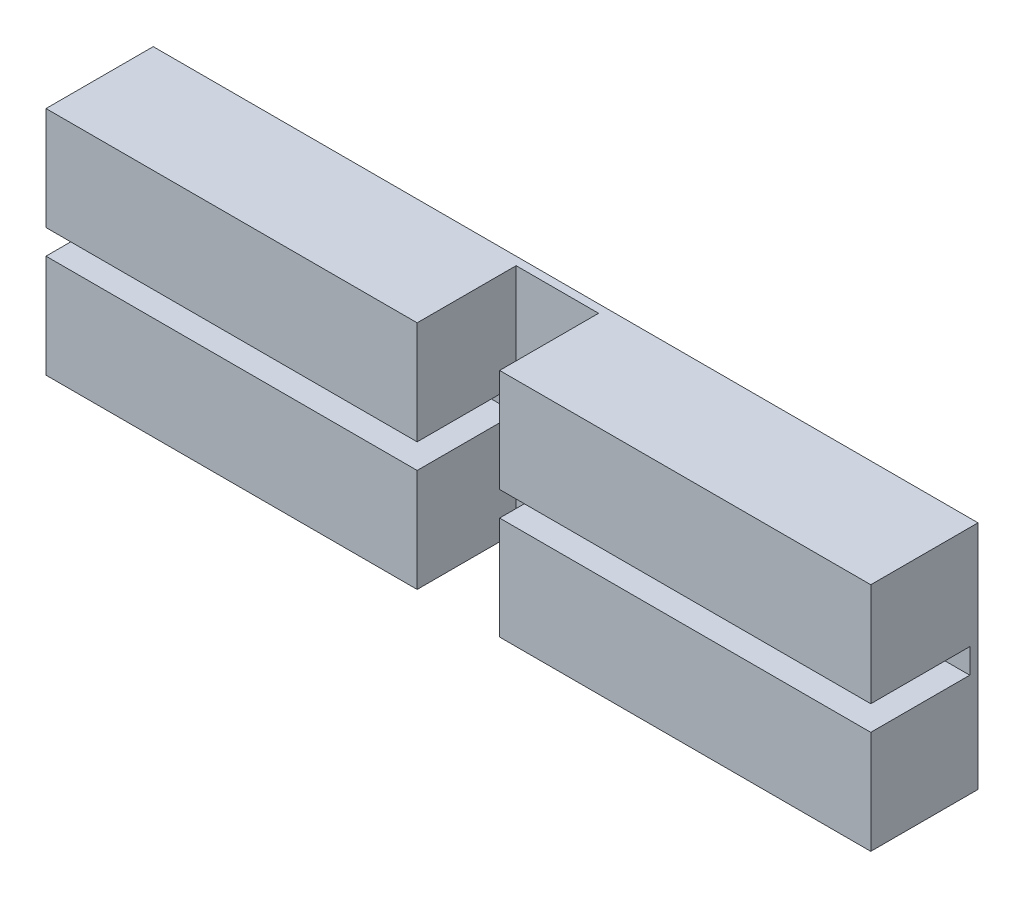
ISO-10303-21;
HEADER;
FILE_DESCRIPTION(('STEP AP214'),'2;1');
FILE_NAME('part.step','',(''),(''),'','','');
FILE_SCHEMA(('AUTOMOTIVE_DESIGN { 1 0 10303 214 1 1 1 1 }'));
ENDSEC;
DATA;
#1=APPLICATION_CONTEXT('core data for automotive mechanical design processes');
#2=APPLICATION_PROTOCOL_DEFINITION('international standard','automotive_design',2000,#1);
#3=PRODUCT_CONTEXT('',#1,'mechanical');
#4=PRODUCT('Part','Part','',(#3));
#5=PRODUCT_RELATED_PRODUCT_CATEGORY('part','',(#4));
#6=PRODUCT_DEFINITION_FORMATION('','',#4);
#7=PRODUCT_DEFINITION_CONTEXT('part definition',#1,'design');
#8=PRODUCT_DEFINITION('design','',#6,#7);
#9=PRODUCT_DEFINITION_SHAPE('','',#8);
#10=(LENGTH_UNIT() NAMED_UNIT(*) SI_UNIT(.MILLI.,.METRE.));
#11=(NAMED_UNIT(*) PLANE_ANGLE_UNIT() SI_UNIT($,.RADIAN.));
#12=(NAMED_UNIT(*) SI_UNIT($,.STERADIAN.) SOLID_ANGLE_UNIT());
#13=UNCERTAINTY_MEASURE_WITH_UNIT(LENGTH_MEASURE(1.E-05),#10,'distance_accuracy_value','');
#14=(GEOMETRIC_REPRESENTATION_CONTEXT(3) GLOBAL_UNCERTAINTY_ASSIGNED_CONTEXT((#13)) GLOBAL_UNIT_ASSIGNED_CONTEXT((#10,
#11,#12)) REPRESENTATION_CONTEXT('',''));
#15=CARTESIAN_POINT('',(0.,0.,0.));
#16=DIRECTION('',(0.,0.,1.));
#17=DIRECTION('',(1.,0.,0.));
#18=AXIS2_PLACEMENT_3D('',#15,#16,#17);
#19=CARTESIAN_POINT('',(0.,0.,2.6));
#20=DIRECTION('',(0.,0.,-1.));
#21=DIRECTION('',(-1.,0.,0.));
#22=AXIS2_PLACEMENT_3D('',#19,#20,#21);
#23=PLANE('',#22);
#24=DIRECTION('',(1.,0.,0.));
#25=VECTOR('',#24,1.);
#26=CARTESIAN_POINT('',(-10.,-0.300000000000002,2.6));
#27=LINE('',#26,#25);
#28=CARTESIAN_POINT('',(0.999999999999994,-0.300000000000002,2.6));
#29=VERTEX_POINT('',#28);
#30=CARTESIAN_POINT('',(9.99999999999999,-0.300000000000002,2.6));
#31=VERTEX_POINT('',#30);
#32=EDGE_CURVE('E223',#29,#31,#27,.T.);
#33=ORIENTED_EDGE('',*,*,#32,.F.);
#34=DIRECTION('',(0.,-1.,0.));
#35=VECTOR('',#34,1.);
#36=CARTESIAN_POINT('',(0.999999999999994,2.8,2.6));
#37=LINE('',#36,#35);
#38=CARTESIAN_POINT('',(0.999999999999994,-2.8,2.6));
#39=VERTEX_POINT('',#38);
#40=EDGE_CURVE('E159',#29,#39,#37,.T.);
#41=ORIENTED_EDGE('',*,*,#40,.T.);
#42=DIRECTION('',(1.,0.,0.));
#43=VECTOR('',#42,1.);
#44=CARTESIAN_POINT('',(-10.,-2.8,2.6));
#45=LINE('',#44,#43);
#46=CARTESIAN_POINT('',(9.99999999999999,-2.8,2.6));
#47=VERTEX_POINT('',#46);
#48=EDGE_CURVE('E186',#39,#47,#45,.T.);
#49=ORIENTED_EDGE('',*,*,#48,.T.);
#50=DIRECTION('',(0.,1.,0.));
#51=VECTOR('',#50,1.);
#52=CARTESIAN_POINT('',(9.99999999999999,-2.8,2.6));
#53=LINE('',#52,#51);
#54=EDGE_CURVE('E181',#47,#31,#53,.T.);
#55=ORIENTED_EDGE('',*,*,#54,.T.);
#56=EDGE_LOOP('',(#33,#41,#49,#55));
#57=FACE_BOUND('',#56,.T.);
#58=ADVANCED_FACE('F37',(#57),#23,.F.);
#59=DIRECTION('',(-1.,0.,0.));
#60=VECTOR('',#59,1.);
#61=CARTESIAN_POINT('',(-10.,2.8,2.6));
#62=LINE('',#61,#60);
#63=CARTESIAN_POINT('',(9.99999999999999,2.8,2.6));
#64=VERTEX_POINT('',#63);
#65=CARTESIAN_POINT('',(0.999999999999994,2.8,2.6));
#66=VERTEX_POINT('',#65);
#67=EDGE_CURVE('E165',#64,#66,#62,.T.);
#68=ORIENTED_EDGE('',*,*,#67,.T.);
#69=CARTESIAN_POINT('',(0.999999999999994,0.299999999999999,2.6));
#70=VERTEX_POINT('',#69);
#71=EDGE_CURVE('E150',#66,#70,#37,.T.);
#72=ORIENTED_EDGE('',*,*,#71,.T.);
#73=DIRECTION('',(1.,0.,0.));
#74=VECTOR('',#73,1.);
#75=CARTESIAN_POINT('',(-10.,0.299999999999999,2.6));
#76=LINE('',#75,#74);
#77=CARTESIAN_POINT('',(9.99999999999999,0.299999999999999,2.6));
#78=VERTEX_POINT('',#77);
#79=EDGE_CURVE('E224',#70,#78,#76,.T.);
#80=ORIENTED_EDGE('',*,*,#79,.T.);
#81=EDGE_CURVE('E175',#78,#64,#53,.T.);
#82=ORIENTED_EDGE('',*,*,#81,.T.);
#83=EDGE_LOOP('',(#68,#72,#80,#82));
#84=FACE_BOUND('',#83,.T.);
#85=ADVANCED_FACE('F173',(#84),#23,.F.);
#86=CARTESIAN_POINT('',(-10.,-0.300000000000001,0.2));
#87=DIRECTION('',(0.,-1.,0.));
#88=DIRECTION('',(0.,0.,-1.));
#89=AXIS2_PLACEMENT_3D('',#86,#87,#88);
#90=PLANE('',#89);
#91=DIRECTION('',(1.,0.,0.));
#92=VECTOR('',#91,1.);
#93=CARTESIAN_POINT('',(-10.,-0.300000000000001,0.2));
#94=LINE('',#93,#92);
#95=CARTESIAN_POINT('',(0.999999999999994,-0.300000000000001,0.2));
#96=VERTEX_POINT('',#95);
#97=CARTESIAN_POINT('',(9.99999999999999,-0.300000000000001,0.2));
#98=VERTEX_POINT('',#97);
#99=EDGE_CURVE('E253',#96,#98,#94,.T.);
#100=ORIENTED_EDGE('',*,*,#99,.F.);
#101=DIRECTION('',(0.,0.,1.));
#102=VECTOR('',#101,1.);
#103=CARTESIAN_POINT('',(0.999999999999994,-0.300000000000001,0.2));
#104=LINE('',#103,#102);
#105=EDGE_CURVE('E248',#96,#29,#104,.T.);
#106=ORIENTED_EDGE('',*,*,#105,.T.);
#107=ORIENTED_EDGE('',*,*,#32,.T.);
#108=DIRECTION('',(0.,0.,-1.));
#109=VECTOR('',#108,1.);
#110=CARTESIAN_POINT('',(9.99999999999999,-0.300000000000001,0.2));
#111=LINE('',#110,#109);
#112=EDGE_CURVE('E250',#31,#98,#111,.T.);
#113=ORIENTED_EDGE('',*,*,#112,.T.);
#114=EDGE_LOOP('',(#100,#106,#107,#113));
#115=FACE_BOUND('',#114,.T.);
#116=ADVANCED_FACE('F309',(#115),#90,.F.);
#117=CARTESIAN_POINT('',(-10.,0.299999999999999,0.2));
#118=DIRECTION('',(0.,1.,0.));
#119=DIRECTION('',(0.,0.,1.));
#120=AXIS2_PLACEMENT_3D('',#117,#118,#119);
#121=PLANE('',#120);
#122=ORIENTED_EDGE('',*,*,#79,.F.);
#123=DIRECTION('',(0.,0.,-1.));
#124=VECTOR('',#123,1.);
#125=CARTESIAN_POINT('',(0.999999999999994,0.299999999999999,0.2));
#126=LINE('',#125,#124);
#127=CARTESIAN_POINT('',(0.999999999999994,0.299999999999999,0.2));
#128=VERTEX_POINT('',#127);
#129=EDGE_CURVE('E11',#70,#128,#126,.T.);
#130=ORIENTED_EDGE('',*,*,#129,.T.);
#131=DIRECTION('',(1.,0.,0.));
#132=VECTOR('',#131,1.);
#133=CARTESIAN_POINT('',(-10.,0.299999999999999,0.2));
#134=LINE('',#133,#132);
#135=CARTESIAN_POINT('',(9.99999999999999,0.299999999999999,0.2));
#136=VERTEX_POINT('',#135);
#137=EDGE_CURVE('E229',#128,#136,#134,.T.);
#138=ORIENTED_EDGE('',*,*,#137,.T.);
#139=DIRECTION('',(0.,0.,1.));
#140=VECTOR('',#139,1.);
#141=CARTESIAN_POINT('',(9.99999999999999,0.299999999999999,0.2));
#142=LINE('',#141,#140);
#143=EDGE_CURVE('E247',#136,#78,#142,.T.);
#144=ORIENTED_EDGE('',*,*,#143,.T.);
#145=EDGE_LOOP('',(#122,#130,#138,#144));
#146=FACE_BOUND('',#145,.T.);
#147=ADVANCED_FACE('F336',(#146),#121,.F.);
#148=CARTESIAN_POINT('',(-10.,-2.8,2.6));
#149=VERTEX_POINT('',#148);
#150=CARTESIAN_POINT('',(-1.00000000000001,-2.8,2.6));
#151=VERTEX_POINT('',#150);
#152=EDGE_CURVE('E187',#149,#151,#45,.T.);
#153=ORIENTED_EDGE('',*,*,#152,.T.);
#154=DIRECTION('',(0.,-1.,0.));
#155=VECTOR('',#154,1.);
#156=CARTESIAN_POINT('',(-1.00000000000001,2.8,2.6));
#157=LINE('',#156,#155);
#158=CARTESIAN_POINT('',(-1.00000000000001,-0.300000000000002,2.6));
#159=VERTEX_POINT('',#158);
#160=EDGE_CURVE('E158',#159,#151,#157,.T.);
#161=ORIENTED_EDGE('',*,*,#160,.F.);
#162=CARTESIAN_POINT('',(-10.,-0.300000000000002,2.6));
#163=VERTEX_POINT('',#162);
#164=EDGE_CURVE('E226',#163,#159,#27,.T.);
#165=ORIENTED_EDGE('',*,*,#164,.F.);
#166=DIRECTION('',(0.,-1.,0.));
#167=VECTOR('',#166,1.);
#168=CARTESIAN_POINT('',(-10.,-2.8,2.6));
#169=LINE('',#168,#167);
#170=EDGE_CURVE('E176',#163,#149,#169,.T.);
#171=ORIENTED_EDGE('',*,*,#170,.T.);
#172=EDGE_LOOP('',(#153,#161,#165,#171));
#173=FACE_BOUND('',#172,.T.);
#174=ADVANCED_FACE('F265',(#173),#23,.F.);
#175=CARTESIAN_POINT('',(9.99999999999999,-2.8,2.6));
#176=DIRECTION('',(-1.,0.,0.));
#177=DIRECTION('',(0.,0.,1.));
#178=AXIS2_PLACEMENT_3D('',#175,#176,#177);
#179=PLANE('',#178);
#180=DIRECTION('',(0.,1.,0.));
#181=VECTOR('',#180,1.);
#182=CARTESIAN_POINT('',(9.99999999999999,-0.300000000000001,0.2));
#183=LINE('',#182,#181);
#184=EDGE_CURVE('E245',#98,#136,#183,.T.);
#185=ORIENTED_EDGE('',*,*,#184,.F.);
#186=ORIENTED_EDGE('',*,*,#112,.F.);
#187=ORIENTED_EDGE('',*,*,#54,.F.);
#188=DIRECTION('',(0.,0.,-1.));
#189=VECTOR('',#188,1.);
#190=CARTESIAN_POINT('',(9.99999999999999,-2.8,2.6));
#191=LINE('',#190,#189);
#192=CARTESIAN_POINT('',(9.99999999999999,-2.8,0.));
#193=VERTEX_POINT('',#192);
#194=EDGE_CURVE('E190',#47,#193,#191,.T.);
#195=ORIENTED_EDGE('',*,*,#194,.T.);
#196=DIRECTION('',(0.,1.,0.));
#197=VECTOR('',#196,1.);
#198=CARTESIAN_POINT('',(9.99999999999999,-2.8,0.));
#199=LINE('',#198,#197);
#200=CARTESIAN_POINT('',(9.99999999999999,2.8,0.));
#201=VERTEX_POINT('',#200);
#202=EDGE_CURVE('E191',#193,#201,#199,.T.);
#203=ORIENTED_EDGE('',*,*,#202,.T.);
#204=DIRECTION('',(0.,0.,-1.));
#205=VECTOR('',#204,1.);
#206=CARTESIAN_POINT('',(9.99999999999999,2.8,2.6));
#207=LINE('',#206,#205);
#208=EDGE_CURVE('E209',#64,#201,#207,.T.);
#209=ORIENTED_EDGE('',*,*,#208,.F.);
#210=ORIENTED_EDGE('',*,*,#81,.F.);
#211=ORIENTED_EDGE('',*,*,#143,.F.);
#212=EDGE_LOOP('',(#185,#186,#187,#195,#203,#209,#210,#211));
#213=FACE_BOUND('',#212,.T.);
#214=ADVANCED_FACE('F39',(#213),#179,.F.);
#215=CARTESIAN_POINT('',(-10.,2.8,2.6));
#216=DIRECTION('',(0.,-1.,0.));
#217=DIRECTION('',(0.,0.,-1.));
#218=AXIS2_PLACEMENT_3D('',#215,#216,#217);
#219=PLANE('',#218);
#220=DIRECTION('',(1.,0.,0.));
#221=VECTOR('',#220,1.);
#222=CARTESIAN_POINT('',(0.999999999999994,2.8,0.2));
#223=LINE('',#222,#221);
#224=CARTESIAN_POINT('',(-1.00000000000001,2.8,0.2));
#225=VERTEX_POINT('',#224);
#226=CARTESIAN_POINT('',(0.999999999999994,2.8,0.2));
#227=VERTEX_POINT('',#226);
#228=EDGE_CURVE('E169',#225,#227,#223,.T.);
#229=ORIENTED_EDGE('',*,*,#228,.T.);
#230=DIRECTION('',(0.,0.,1.));
#231=VECTOR('',#230,1.);
#232=CARTESIAN_POINT('',(0.999999999999994,2.8,0.2));
#233=LINE('',#232,#231);
#234=EDGE_CURVE('E153',#227,#66,#233,.T.);
#235=ORIENTED_EDGE('',*,*,#234,.T.);
#236=ORIENTED_EDGE('',*,*,#67,.F.);
#237=ORIENTED_EDGE('',*,*,#208,.T.);
#238=DIRECTION('',(-1.,0.,0.));
#239=VECTOR('',#238,1.);
#240=CARTESIAN_POINT('',(-10.,2.8,0.));
#241=LINE('',#240,#239);
#242=CARTESIAN_POINT('',(-10.,2.8,0.));
#243=VERTEX_POINT('',#242);
#244=EDGE_CURVE('E194',#201,#243,#241,.T.);
#245=ORIENTED_EDGE('',*,*,#244,.T.);
#246=DIRECTION('',(0.,0.,-1.));
#247=VECTOR('',#246,1.);
#248=CARTESIAN_POINT('',(-10.,2.8,2.6));
#249=LINE('',#248,#247);
#250=CARTESIAN_POINT('',(-10.,2.8,2.6));
#251=VERTEX_POINT('',#250);
#252=EDGE_CURVE('E206',#251,#243,#249,.T.);
#253=ORIENTED_EDGE('',*,*,#252,.F.);
#254=CARTESIAN_POINT('',(-1.00000000000001,2.8,2.6));
#255=VERTEX_POINT('',#254);
#256=EDGE_CURVE('E177',#255,#251,#62,.T.);
#257=ORIENTED_EDGE('',*,*,#256,.F.);
#258=DIRECTION('',(0.,0.,-1.));
#259=VECTOR('',#258,1.);
#260=CARTESIAN_POINT('',(-1.00000000000001,2.8,0.2));
#261=LINE('',#260,#259);
#262=EDGE_CURVE('E170',#255,#225,#261,.T.);
#263=ORIENTED_EDGE('',*,*,#262,.T.);
#264=EDGE_LOOP('',(#229,#235,#236,#237,#245,#253,#257,#263));
#265=FACE_BOUND('',#264,.T.);
#266=ADVANCED_FACE('F163',(#265),#219,.F.);
#267=CARTESIAN_POINT('',(-10.,-2.8,2.6));
#268=DIRECTION('',(1.,0.,0.));
#269=DIRECTION('',(0.,0.,-1.));
#270=AXIS2_PLACEMENT_3D('',#267,#268,#269);
#271=PLANE('',#270);
#272=ORIENTED_EDGE('',*,*,#170,.F.);
#273=DIRECTION('',(0.,0.,-1.));
#274=VECTOR('',#273,1.);
#275=CARTESIAN_POINT('',(-10.,-0.300000000000001,0.2));
#276=LINE('',#275,#274);
#277=CARTESIAN_POINT('',(-10.,-0.300000000000001,0.2));
#278=VERTEX_POINT('',#277);
#279=EDGE_CURVE('E230',#163,#278,#276,.T.);
#280=ORIENTED_EDGE('',*,*,#279,.T.);
#281=DIRECTION('',(0.,1.,0.));
#282=VECTOR('',#281,1.);
#283=CARTESIAN_POINT('',(-10.,-0.300000000000001,0.2));
#284=LINE('',#283,#282);
#285=CARTESIAN_POINT('',(-10.,0.299999999999999,0.2));
#286=VERTEX_POINT('',#285);
#287=EDGE_CURVE('E241',#278,#286,#284,.T.);
#288=ORIENTED_EDGE('',*,*,#287,.T.);
#289=DIRECTION('',(0.,0.,1.));
#290=VECTOR('',#289,1.);
#291=CARTESIAN_POINT('',(-10.,0.299999999999999,0.2));
#292=LINE('',#291,#290);
#293=CARTESIAN_POINT('',(-10.,0.299999999999999,2.6));
#294=VERTEX_POINT('',#293);
#295=EDGE_CURVE('E236',#286,#294,#292,.T.);
#296=ORIENTED_EDGE('',*,*,#295,.T.);
#297=EDGE_CURVE('E179',#251,#294,#169,.T.);
#298=ORIENTED_EDGE('',*,*,#297,.F.);
#299=ORIENTED_EDGE('',*,*,#252,.T.);
#300=DIRECTION('',(0.,-1.,0.));
#301=VECTOR('',#300,1.);
#302=CARTESIAN_POINT('',(-10.,-2.8,0.));
#303=LINE('',#302,#301);
#304=CARTESIAN_POINT('',(-10.,-2.8,0.));
#305=VERTEX_POINT('',#304);
#306=EDGE_CURVE('E197',#243,#305,#303,.T.);
#307=ORIENTED_EDGE('',*,*,#306,.T.);
#308=DIRECTION('',(0.,0.,-1.));
#309=VECTOR('',#308,1.);
#310=CARTESIAN_POINT('',(-10.,-2.8,2.6));
#311=LINE('',#310,#309);
#312=EDGE_CURVE('E203',#149,#305,#311,.T.);
#313=ORIENTED_EDGE('',*,*,#312,.F.);
#314=EDGE_LOOP('',(#272,#280,#288,#296,#298,#299,#307,#313));
#315=FACE_BOUND('',#314,.T.);
#316=ADVANCED_FACE('F267',(#315),#271,.F.);
#317=CARTESIAN_POINT('',(-10.,-2.8,2.6));
#318=DIRECTION('',(0.,1.,0.));
#319=DIRECTION('',(0.,0.,1.));
#320=AXIS2_PLACEMENT_3D('',#317,#318,#319);
#321=PLANE('',#320);
#322=ORIENTED_EDGE('',*,*,#48,.F.);
#323=DIRECTION('',(0.,0.,1.));
#324=VECTOR('',#323,1.);
#325=CARTESIAN_POINT('',(0.999999999999994,-2.8,0.2));
#326=LINE('',#325,#324);
#327=CARTESIAN_POINT('',(0.999999999999994,-2.8,0.2));
#328=VERTEX_POINT('',#327);
#329=EDGE_CURVE('E279',#328,#39,#326,.T.);
#330=ORIENTED_EDGE('',*,*,#329,.F.);
#331=DIRECTION('',(1.,0.,0.));
#332=VECTOR('',#331,1.);
#333=CARTESIAN_POINT('',(0.999999999999994,-2.8,0.2));
#334=LINE('',#333,#332);
#335=CARTESIAN_POINT('',(-1.00000000000001,-2.8,0.2));
#336=VERTEX_POINT('',#335);
#337=EDGE_CURVE('E171',#336,#328,#334,.T.);
#338=ORIENTED_EDGE('',*,*,#337,.F.);
#339=DIRECTION('',(0.,0.,-1.));
#340=VECTOR('',#339,1.);
#341=CARTESIAN_POINT('',(-1.00000000000001,-2.8,0.2));
#342=LINE('',#341,#340);
#343=EDGE_CURVE('E276',#151,#336,#342,.T.);
#344=ORIENTED_EDGE('',*,*,#343,.F.);
#345=ORIENTED_EDGE('',*,*,#152,.F.);
#346=ORIENTED_EDGE('',*,*,#312,.T.);
#347=DIRECTION('',(1.,0.,0.));
#348=VECTOR('',#347,1.);
#349=CARTESIAN_POINT('',(-10.,-2.8,0.));
#350=LINE('',#349,#348);
#351=EDGE_CURVE('E199',#305,#193,#350,.T.);
#352=ORIENTED_EDGE('',*,*,#351,.T.);
#353=ORIENTED_EDGE('',*,*,#194,.F.);
#354=EDGE_LOOP('',(#322,#330,#338,#344,#345,#346,#352,#353));
#355=FACE_BOUND('',#354,.T.);
#356=ADVANCED_FACE('F274',(#355),#321,.F.);
#357=CARTESIAN_POINT('',(-1.00000000000001,0.299999999999999,2.6));
#358=VERTEX_POINT('',#357);
#359=EDGE_CURVE('E215',#294,#358,#76,.T.);
#360=ORIENTED_EDGE('',*,*,#359,.T.);
#361=EDGE_CURVE('E60',#255,#358,#157,.T.);
#362=ORIENTED_EDGE('',*,*,#361,.F.);
#363=ORIENTED_EDGE('',*,*,#256,.T.);
#364=ORIENTED_EDGE('',*,*,#297,.T.);
#365=EDGE_LOOP('',(#360,#362,#363,#364));
#366=FACE_BOUND('',#365,.T.);
#367=ADVANCED_FACE('F220',(#366),#23,.F.);
#368=CARTESIAN_POINT('',(0.,0.,0.));
#369=DIRECTION('',(0.,0.,-1.));
#370=DIRECTION('',(-1.,0.,0.));
#371=AXIS2_PLACEMENT_3D('',#368,#369,#370);
#372=PLANE('',#371);
#373=ORIENTED_EDGE('',*,*,#202,.F.);
#374=ORIENTED_EDGE('',*,*,#351,.F.);
#375=ORIENTED_EDGE('',*,*,#306,.F.);
#376=ORIENTED_EDGE('',*,*,#244,.F.);
#377=EDGE_LOOP('',(#373,#374,#375,#376));
#378=FACE_BOUND('',#377,.T.);
#379=ADVANCED_FACE('F328',(#378),#372,.T.);
#380=CARTESIAN_POINT('',(-10.,-0.300000000000001,0.2));
#381=DIRECTION('',(0.,0.,-1.));
#382=DIRECTION('',(-1.,0.,0.));
#383=AXIS2_PLACEMENT_3D('',#380,#381,#382);
#384=PLANE('',#383);
#385=CARTESIAN_POINT('',(-1.00000000000001,-0.300000000000001,0.2));
#386=VERTEX_POINT('',#385);
#387=EDGE_CURVE('E195',#278,#386,#94,.T.);
#388=ORIENTED_EDGE('',*,*,#387,.T.);
#389=DIRECTION('',(0.,-1.,0.));
#390=VECTOR('',#389,1.);
#391=CARTESIAN_POINT('',(-1.00000000000001,2.8,0.2));
#392=LINE('',#391,#390);
#393=EDGE_CURVE('E52',#386,#336,#392,.T.);
#394=ORIENTED_EDGE('',*,*,#393,.T.);
#395=ORIENTED_EDGE('',*,*,#337,.T.);
#396=DIRECTION('',(0.,-1.,0.));
#397=VECTOR('',#396,1.);
#398=CARTESIAN_POINT('',(0.999999999999994,2.8,0.2));
#399=LINE('',#398,#397);
#400=EDGE_CURVE('E287',#96,#328,#399,.T.);
#401=ORIENTED_EDGE('',*,*,#400,.F.);
#402=ORIENTED_EDGE('',*,*,#99,.T.);
#403=ORIENTED_EDGE('',*,*,#184,.T.);
#404=ORIENTED_EDGE('',*,*,#137,.F.);
#405=EDGE_CURVE('E285',#227,#128,#399,.T.);
#406=ORIENTED_EDGE('',*,*,#405,.F.);
#407=ORIENTED_EDGE('',*,*,#228,.F.);
#408=CARTESIAN_POINT('',(-1.00000000000001,0.299999999999999,0.2));
#409=VERTEX_POINT('',#408);
#410=EDGE_CURVE('E288',#225,#409,#392,.T.);
#411=ORIENTED_EDGE('',*,*,#410,.T.);
#412=EDGE_CURVE('E217',#286,#409,#134,.T.);
#413=ORIENTED_EDGE('',*,*,#412,.F.);
#414=ORIENTED_EDGE('',*,*,#287,.F.);
#415=EDGE_LOOP('',(#388,#394,#395,#401,#402,#403,#404,#406,#407,#411,#413,#414));
#416=FACE_BOUND('',#415,.T.);
#417=ADVANCED_FACE('F293',(#416),#384,.F.);
#418=ORIENTED_EDGE('',*,*,#164,.T.);
#419=DIRECTION('',(0.,0.,-1.));
#420=VECTOR('',#419,1.);
#421=CARTESIAN_POINT('',(-1.00000000000001,-0.300000000000001,0.2));
#422=LINE('',#421,#420);
#423=EDGE_CURVE('E262',#159,#386,#422,.T.);
#424=ORIENTED_EDGE('',*,*,#423,.T.);
#425=ORIENTED_EDGE('',*,*,#387,.F.);
#426=ORIENTED_EDGE('',*,*,#279,.F.);
#427=EDGE_LOOP('',(#418,#424,#425,#426));
#428=FACE_BOUND('',#427,.T.);
#429=ADVANCED_FACE('F261',(#428),#90,.F.);
#430=ORIENTED_EDGE('',*,*,#412,.T.);
#431=DIRECTION('',(0.,0.,1.));
#432=VECTOR('',#431,1.);
#433=CARTESIAN_POINT('',(-1.00000000000001,0.299999999999999,0.2));
#434=LINE('',#433,#432);
#435=EDGE_CURVE('E45',#409,#358,#434,.T.);
#436=ORIENTED_EDGE('',*,*,#435,.T.);
#437=ORIENTED_EDGE('',*,*,#359,.F.);
#438=ORIENTED_EDGE('',*,*,#295,.F.);
#439=EDGE_LOOP('',(#430,#436,#437,#438));
#440=FACE_BOUND('',#439,.T.);
#441=ADVANCED_FACE('F213',(#440),#121,.F.);
#442=CARTESIAN_POINT('',(-1.00000000000001,2.8,0.2));
#443=DIRECTION('',(-1.,0.,0.));
#444=DIRECTION('',(0.,0.,1.));
#445=AXIS2_PLACEMENT_3D('',#442,#443,#444);
#446=PLANE('',#445);
#447=ORIENTED_EDGE('',*,*,#410,.F.);
#448=ORIENTED_EDGE('',*,*,#262,.F.);
#449=ORIENTED_EDGE('',*,*,#361,.T.);
#450=ORIENTED_EDGE('',*,*,#435,.F.);
#451=EDGE_LOOP('',(#447,#448,#449,#450));
#452=FACE_BOUND('',#451,.T.);
#453=ADVANCED_FACE('F294',(#452),#446,.F.);
#454=CARTESIAN_POINT('',(0.999999999999994,2.8,0.2));
#455=DIRECTION('',(1.,0.,0.));
#456=DIRECTION('',(0.,0.,-1.));
#457=AXIS2_PLACEMENT_3D('',#454,#455,#456);
#458=PLANE('',#457);
#459=ORIENTED_EDGE('',*,*,#71,.F.);
#460=ORIENTED_EDGE('',*,*,#234,.F.);
#461=ORIENTED_EDGE('',*,*,#405,.T.);
#462=ORIENTED_EDGE('',*,*,#129,.F.);
#463=EDGE_LOOP('',(#459,#460,#461,#462));
#464=FACE_BOUND('',#463,.T.);
#465=ADVANCED_FACE('F152',(#464),#458,.F.);
#466=ORIENTED_EDGE('',*,*,#400,.T.);
#467=ORIENTED_EDGE('',*,*,#329,.T.);
#468=ORIENTED_EDGE('',*,*,#40,.F.);
#469=ORIENTED_EDGE('',*,*,#105,.F.);
#470=EDGE_LOOP('',(#466,#467,#468,#469));
#471=FACE_BOUND('',#470,.T.);
#472=ADVANCED_FACE('F310',(#471),#458,.F.);
#473=ORIENTED_EDGE('',*,*,#160,.T.);
#474=ORIENTED_EDGE('',*,*,#343,.T.);
#475=ORIENTED_EDGE('',*,*,#393,.F.);
#476=ORIENTED_EDGE('',*,*,#423,.F.);
#477=EDGE_LOOP('',(#473,#474,#475,#476));
#478=FACE_BOUND('',#477,.T.);
#479=ADVANCED_FACE('F312',(#478),#446,.F.);
#480=CLOSED_SHELL('',(#58,#85,#116,#147,#174,#214,#266,#316,#356,#367,#379,#417,#429,#441,#453,
#465,#472,#479));
#481=MANIFOLD_SOLID_BREP('B2',#480);
#482=ADVANCED_BREP_SHAPE_REPRESENTATION('',(#18,#481),#14);
#483=SHAPE_DEFINITION_REPRESENTATION(#9,#482);
ENDSEC;
END-ISO-10303-21;
